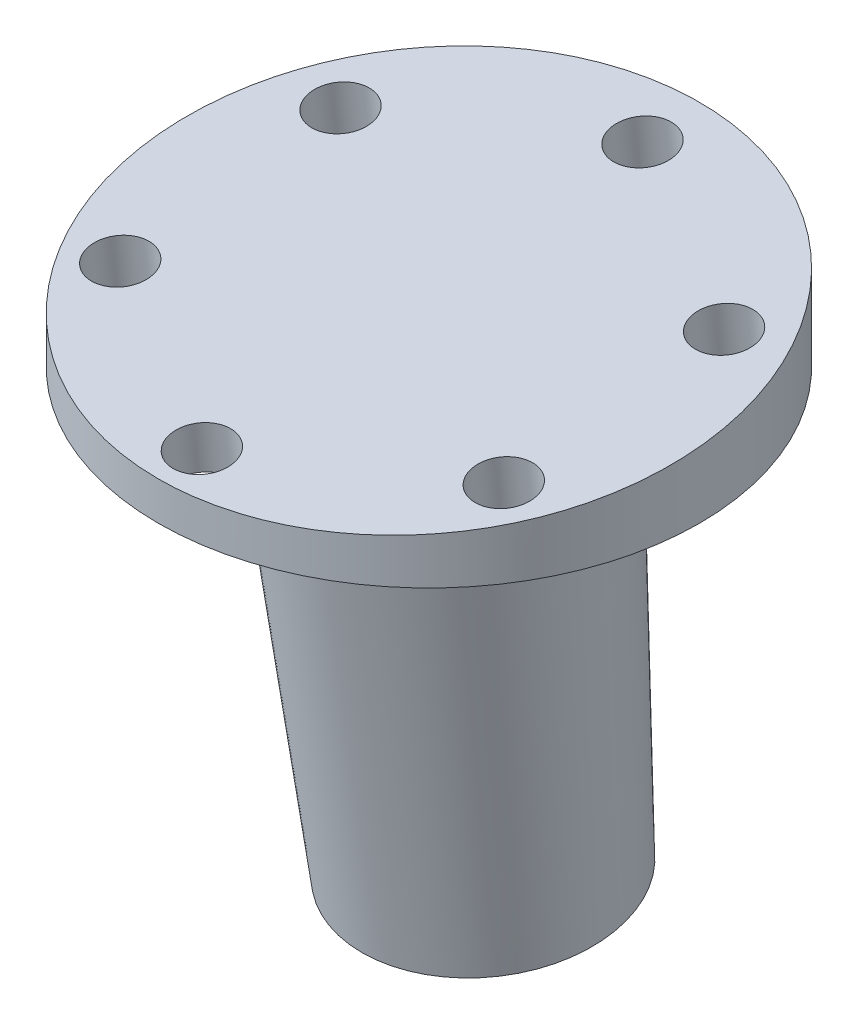
ISO-10303-21;
HEADER;
FILE_DESCRIPTION(('STEP AP214'),'2;1');
FILE_NAME('part.step','',(''),(''),'','','');
FILE_SCHEMA(('AUTOMOTIVE_DESIGN { 1 0 10303 214 1 1 1 1 }'));
ENDSEC;
DATA;
#1=APPLICATION_CONTEXT('core data for automotive mechanical design processes');
#2=APPLICATION_PROTOCOL_DEFINITION('international standard','automotive_design',2000,#1);
#3=PRODUCT_CONTEXT('',#1,'mechanical');
#4=PRODUCT('Part','Part','',(#3));
#5=PRODUCT_RELATED_PRODUCT_CATEGORY('part','',(#4));
#6=PRODUCT_DEFINITION_FORMATION('','',#4);
#7=PRODUCT_DEFINITION_CONTEXT('part definition',#1,'design');
#8=PRODUCT_DEFINITION('design','',#6,#7);
#9=PRODUCT_DEFINITION_SHAPE('','',#8);
#10=(LENGTH_UNIT() NAMED_UNIT(*) SI_UNIT(.MILLI.,.METRE.));
#11=(NAMED_UNIT(*) PLANE_ANGLE_UNIT() SI_UNIT($,.RADIAN.));
#12=(NAMED_UNIT(*) SI_UNIT($,.STERADIAN.) SOLID_ANGLE_UNIT());
#13=UNCERTAINTY_MEASURE_WITH_UNIT(LENGTH_MEASURE(1.E-05),#10,'distance_accuracy_value','');
#14=(GEOMETRIC_REPRESENTATION_CONTEXT(3) GLOBAL_UNCERTAINTY_ASSIGNED_CONTEXT((#13)) GLOBAL_UNIT_ASSIGNED_CONTEXT((#10,
#11,#12)) REPRESENTATION_CONTEXT('',''));
#15=CARTESIAN_POINT('',(0.,0.,0.));
#16=DIRECTION('',(0.,0.,1.));
#17=DIRECTION('',(1.,0.,0.));
#18=AXIS2_PLACEMENT_3D('',#15,#16,#17);
#19=CARTESIAN_POINT('',(0.,-53.9256880404723,-6.33320651284471));
#20=DIRECTION('',(0.,0.994769161943102,0.102148492142657));
#21=DIRECTION('',(0.,-0.102148492142657,0.994769161943102));
#22=AXIS2_PLACEMENT_3D('',#19,#20,#21);
#23=PLANE('',#22);
#24=CARTESIAN_POINT('',(0.,-53.9256880404723,-6.33320651284471));
#25=DIRECTION('',(0.,0.994769161943102,0.102148492142657));
#26=DIRECTION('',(0.,-0.102148492142657,0.994769161943102));
#27=AXIS2_PLACEMENT_3D('',#24,#25,#26);
#28=CIRCLE('',#27,10.0442361468087);
#29=CARTESIAN_POINT('',(0.,-54.9516916175936,3.65848986127483));
#30=VERTEX_POINT('',#29);
#31=EDGE_CURVE('E54',#30,#30,#28,.T.);
#32=ORIENTED_EDGE('',*,*,#31,.T.);
#33=EDGE_LOOP('',(#32));
#34=FACE_BOUND('',#33,.T.);
#35=CARTESIAN_POINT('',(0.,-53.9256880404723,-6.33320651284471));
#36=DIRECTION('',(0.,0.994769161943102,0.102148492142657));
#37=DIRECTION('',(0.,-0.102148492142657,0.994769161943102));
#38=AXIS2_PLACEMENT_3D('',#35,#36,#37);
#39=CIRCLE('',#38,14.25);
#40=CARTESIAN_POINT('',(0.,-55.3813040535052,7.8422540448445));
#41=VERTEX_POINT('',#40);
#42=EDGE_CURVE('E46',#41,#41,#39,.T.);
#43=ORIENTED_EDGE('',*,*,#42,.F.);
#44=EDGE_LOOP('',(#43));
#45=FACE_BOUND('',#44,.T.);
#46=ADVANCED_FACE('F39',(#34,#45),#23,.F.);
#47=CARTESIAN_POINT('',(0.,-53.9256880404723,-6.33320651284471));
#48=DIRECTION('',(0.,0.994769161943102,0.102148492142657));
#49=DIRECTION('',(0.,-0.102148492142657,0.994769161943102));
#50=AXIS2_PLACEMENT_3D('',#47,#48,#49);
#51=CONICAL_SURFACE('',#50,14.25,0.05235987755983);
#52=ORIENTED_EDGE('',*,*,#42,.T.);
#53=EDGE_LOOP('',(#52));
#54=FACE_BOUND('',#53,.T.);
#55=CARTESIAN_POINT('',(0.,0.,-0.703351690237273));
#56=DIRECTION('',(0.,1.,0.));
#57=DIRECTION('',(0.,0.,1.));
#58=AXIS2_PLACEMENT_3D('',#55,#56,#57);
#59=ELLIPSE('',#58,17.1813541602165,17.0912337855842);
#60=CARTESIAN_POINT('',(0.,0.,16.4780024699792));
#61=VERTEX_POINT('',#60);
#62=EDGE_CURVE('E10',#61,#61,#59,.T.);
#63=ORIENTED_EDGE('',*,*,#62,.F.);
#64=EDGE_LOOP('',(#63));
#65=FACE_BOUND('',#64,.T.);
#66=ADVANCED_FACE('F41',(#54,#65),#51,.T.);
#67=CARTESIAN_POINT('',(0.,-4.2,31.65));
#68=DIRECTION('',(0.,-1.,0.));
#69=DIRECTION('',(0.,0.,-1.));
#70=AXIS2_PLACEMENT_3D('',#67,#68,#69);
#71=PLANE('',#70);
#72=CARTESIAN_POINT('',(0.,-4.2,-1.15858147671368));
#73=DIRECTION('',(0.,-1.,0.));
#74=DIRECTION('',(0.,0.,1.));
#75=AXIS2_PLACEMENT_3D('',#72,#73,#74);
#76=ELLIPSE('',#75,12.73091245188,12.6641357246864);
#77=CARTESIAN_POINT('',(0.,-4.2,11.5723309751663));
#78=VERTEX_POINT('',#77);
#79=EDGE_CURVE('E50',#78,#78,#76,.F.);
#80=ORIENTED_EDGE('',*,*,#79,.F.);
#81=EDGE_LOOP('',(#80));
#82=FACE_BOUND('',#81,.T.);
#83=ADVANCED_FACE('F116',(#82),#71,.T.);
#84=CARTESIAN_POINT('',(0.,-53.7070268200809,-6.31075314898146));
#85=DIRECTION('',(0.,0.994769161943102,0.102148492142657));
#86=DIRECTION('',(0.,-0.102148492142657,0.994769161943102));
#87=AXIS2_PLACEMENT_3D('',#84,#85,#86);
#88=CONICAL_SURFACE('',#87,10.0557559540308,0.05235987755983);
#89=ORIENTED_EDGE('',*,*,#31,.F.);
#90=EDGE_LOOP('',(#89));
#91=FACE_BOUND('',#90,.T.);
#92=ORIENTED_EDGE('',*,*,#79,.T.);
#93=EDGE_LOOP('',(#92));
#94=FACE_BOUND('',#93,.T.);
#95=ADVANCED_FACE('F106',(#91,#94),#88,.F.);
#96=CARTESIAN_POINT('',(0.,0.,31.65));
#97=DIRECTION('',(0.,-1.,0.));
#98=DIRECTION('',(0.,0.,-1.));
#99=AXIS2_PLACEMENT_3D('',#96,#97,#98);
#100=PLANE('',#99);
#101=ORIENTED_EDGE('',*,*,#62,.T.);
#102=EDGE_LOOP('',(#101));
#103=FACE_BOUND('',#102,.T.);
#104=CARTESIAN_POINT('',(0.,0.,26.0359656809894));
#105=DIRECTION('',(0.,1.,0.));
#106=DIRECTION('',(0.,0.,1.));
#107=AXIS2_PLACEMENT_3D('',#104,#105,#106);
#108=ELLIPSE('',#107,3.39274690965243,3.375);
#109=CARTESIAN_POINT('',(0.,0.,29.4287125906419));
#110=VERTEX_POINT('',#109);
#111=EDGE_CURVE('E92',#110,#110,#108,.T.);
#112=ORIENTED_EDGE('',*,*,#111,.T.);
#113=EDGE_LOOP('',(#112));
#114=FACE_BOUND('',#113,.T.);
#115=CARTESIAN_POINT('',(22.4298637612226,0.,13.017982840495));
#116=DIRECTION('',(0.,1.,0.));
#117=DIRECTION('',(0.,0.,1.));
#118=AXIS2_PLACEMENT_3D('',#115,#116,#117);
#119=ELLIPSE('',#118,3.39274690965243,3.375);
#120=CARTESIAN_POINT('',(22.4298637612226,0.,16.4107297501474));
#121=VERTEX_POINT('',#120);
#122=EDGE_CURVE('E89',#121,#121,#119,.T.);
#123=ORIENTED_EDGE('',*,*,#122,.T.);
#124=EDGE_LOOP('',(#123));
#125=FACE_BOUND('',#124,.T.);
#126=CARTESIAN_POINT('',(22.4298637612229,0.,-13.0179828404945));
#127=DIRECTION('',(0.,1.,0.));
#128=DIRECTION('',(0.,0.,1.));
#129=AXIS2_PLACEMENT_3D('',#126,#127,#128);
#130=ELLIPSE('',#129,3.39274690965243,3.375);
#131=CARTESIAN_POINT('',(22.4298637612229,0.,-9.62523593084208));
#132=VERTEX_POINT('',#131);
#133=EDGE_CURVE('E86',#132,#132,#130,.T.);
#134=ORIENTED_EDGE('',*,*,#133,.T.);
#135=EDGE_LOOP('',(#134));
#136=FACE_BOUND('',#135,.T.);
#137=CARTESIAN_POINT('',(1.78206552359005E-13,0.,-26.0359656809894));
#138=DIRECTION('',(0.,1.,0.));
#139=DIRECTION('',(0.,0.,1.));
#140=AXIS2_PLACEMENT_3D('',#137,#138,#139);
#141=ELLIPSE('',#140,3.39274690965243,3.375);
#142=CARTESIAN_POINT('',(1.78206552359005E-13,0.,-22.643218771337));
#143=VERTEX_POINT('',#142);
#144=EDGE_CURVE('E83',#143,#143,#141,.T.);
#145=ORIENTED_EDGE('',*,*,#144,.T.);
#146=EDGE_LOOP('',(#145));
#147=FACE_BOUND('',#146,.T.);
#148=CARTESIAN_POINT('',(-22.4298637612227,0.,-13.0179828404948));
#149=DIRECTION('',(0.,1.,0.));
#150=DIRECTION('',(0.,0.,1.));
#151=AXIS2_PLACEMENT_3D('',#148,#149,#150);
#152=ELLIPSE('',#151,3.39274690965243,3.375);
#153=CARTESIAN_POINT('',(-22.4298637612227,0.,-9.6252359308424));
#154=VERTEX_POINT('',#153);
#155=EDGE_CURVE('E80',#154,#154,#152,.T.);
#156=ORIENTED_EDGE('',*,*,#155,.T.);
#157=EDGE_LOOP('',(#156));
#158=FACE_BOUND('',#157,.T.);
#159=CARTESIAN_POINT('',(-22.4298637612228,0.,13.0179828404947));
#160=DIRECTION('',(0.,1.,0.));
#161=DIRECTION('',(0.,0.,1.));
#162=AXIS2_PLACEMENT_3D('',#159,#160,#161);
#163=ELLIPSE('',#162,3.39274690965243,3.375);
#164=CARTESIAN_POINT('',(-22.4298637612228,0.,16.4107297501471));
#165=VERTEX_POINT('',#164);
#166=EDGE_CURVE('E64',#165,#165,#163,.T.);
#167=ORIENTED_EDGE('',*,*,#166,.T.);
#168=EDGE_LOOP('',(#167));
#169=FACE_BOUND('',#168,.T.);
#170=CARTESIAN_POINT('',(0.,0.,0.));
#171=DIRECTION('',(0.,1.,0.));
#172=DIRECTION('',(0.,0.,1.));
#173=AXIS2_PLACEMENT_3D('',#170,#171,#172);
#174=CIRCLE('',#173,31.65);
#175=CARTESIAN_POINT('',(0.,0.,31.65));
#176=VERTEX_POINT('',#175);
#177=EDGE_CURVE('E98',#176,#176,#174,.T.);
#178=ORIENTED_EDGE('',*,*,#177,.F.);
#179=EDGE_LOOP('',(#178));
#180=FACE_BOUND('',#179,.T.);
#181=ADVANCED_FACE('F104',(#103,#114,#125,#136,#147,#158,#169,#180),#100,.T.);
#182=CARTESIAN_POINT('',(0.,11.,0.));
#183=DIRECTION('',(0.,-1.,0.));
#184=DIRECTION('',(0.,0.,-1.));
#185=AXIS2_PLACEMENT_3D('',#182,#183,#184);
#186=CYLINDRICAL_SURFACE('',#185,31.65);
#187=CARTESIAN_POINT('',(0.,7.75,0.));
#188=DIRECTION('',(0.,-0.994769161943102,-0.102148492142657));
#189=DIRECTION('',(0.,-0.102148492142657,0.994769161943102));
#190=AXIS2_PLACEMENT_3D('',#187,#188,#189);
#191=ELLIPSE('',#190,31.8164265749628,31.65);
#192=CARTESIAN_POINT('',(0.,4.5,31.65));
#193=VERTEX_POINT('',#192);
#194=EDGE_CURVE('E95',#193,#193,#191,.T.);
#195=ORIENTED_EDGE('',*,*,#194,.T.);
#196=EDGE_LOOP('',(#195));
#197=FACE_BOUND('',#196,.T.);
#198=ORIENTED_EDGE('',*,*,#177,.T.);
#199=EDGE_LOOP('',(#198));
#200=FACE_BOUND('',#199,.T.);
#201=ADVANCED_FACE('F102',(#197,#200),#186,.T.);
#202=CARTESIAN_POINT('',(-35.5,11.,-31.65));
#203=DIRECTION('',(0.,-0.994769161943102,-0.102148492142657));
#204=DIRECTION('',(0.,0.102148492142657,-0.994769161943102));
#205=AXIS2_PLACEMENT_3D('',#202,#203,#204);
#206=PLANE('',#205);
#207=CARTESIAN_POINT('',(0.,5.02351102223112,26.5518080450416));
#208=DIRECTION('',(0.,0.994769161943102,0.102148492142657));
#209=DIRECTION('',(0.,-0.102148492142657,0.994769161943102));
#210=AXIS2_PLACEMENT_3D('',#207,#208,#209);
#211=CIRCLE('',#210,3.375);
#212=CARTESIAN_POINT('',(0.,4.67875986124965,29.9091539665996));
#213=VERTEX_POINT('',#212);
#214=EDGE_CURVE('E60',#213,#213,#211,.T.);
#215=ORIENTED_EDGE('',*,*,#214,.F.);
#216=EDGE_LOOP('',(#215));
#217=FACE_BOUND('',#216,.T.);
#218=CARTESIAN_POINT('',(22.4298637612226,6.34632254263334,13.6696589309708));
#219=DIRECTION('',(0.,0.994769161943102,0.102148492142657));
#220=DIRECTION('',(0.,-0.102148492142657,0.994769161943102));
#221=AXIS2_PLACEMENT_3D('',#218,#219,#220);
#222=CIRCLE('',#221,3.375);
#223=CARTESIAN_POINT('',(22.4298637612226,6.00157138165187,17.0270048525287));
#224=VERTEX_POINT('',#223);
#225=EDGE_CURVE('E58',#224,#224,#222,.T.);
#226=ORIENTED_EDGE('',*,*,#225,.F.);
#227=EDGE_LOOP('',(#226));
#228=FACE_BOUND('',#227,.T.);
#229=CARTESIAN_POINT('',(22.4298637612229,8.99194558343784,-12.0946392971715));
#230=DIRECTION('',(0.,0.994769161943102,0.102148492142657));
#231=DIRECTION('',(0.,-0.102148492142657,0.994769161943102));
#232=AXIS2_PLACEMENT_3D('',#229,#230,#231);
#233=CIRCLE('',#232,3.375);
#234=CARTESIAN_POINT('',(22.4298637612229,8.64719442245637,-8.73729337561354));
#235=VERTEX_POINT('',#234);
#236=EDGE_CURVE('E67',#235,#235,#233,.T.);
#237=ORIENTED_EDGE('',*,*,#236,.F.);
#238=EDGE_LOOP('',(#237));
#239=FACE_BOUND('',#238,.T.);
#240=CARTESIAN_POINT('',(1.78206552359005E-13,10.3147571038401,-24.9767884112428));
#241=DIRECTION('',(0.,0.994769161943102,0.102148492142657));
#242=DIRECTION('',(0.,-0.102148492142657,0.994769161943102));
#243=AXIS2_PLACEMENT_3D('',#240,#241,#242);
#244=CIRCLE('',#243,3.375);
#245=CARTESIAN_POINT('',(1.78206552359005E-13,9.97000594285864,-21.6194424896849));
#246=VERTEX_POINT('',#245);
#247=EDGE_CURVE('E73',#246,#246,#244,.T.);
#248=ORIENTED_EDGE('',*,*,#247,.F.);
#249=EDGE_LOOP('',(#248));
#250=FACE_BOUND('',#249,.T.);
#251=CARTESIAN_POINT('',(-22.4298637612227,8.99194558343787,-12.0946392971718));
#252=DIRECTION('',(0.,0.994769161943102,0.102148492142657));
#253=DIRECTION('',(0.,-0.102148492142657,0.994769161943102));
#254=AXIS2_PLACEMENT_3D('',#251,#252,#253);
#255=CIRCLE('',#254,3.375);
#256=CARTESIAN_POINT('',(-22.4298637612227,8.6471944224564,-8.73729337561386));
#257=VERTEX_POINT('',#256);
#258=EDGE_CURVE('E70',#257,#257,#255,.T.);
#259=ORIENTED_EDGE('',*,*,#258,.F.);
#260=EDGE_LOOP('',(#259));
#261=FACE_BOUND('',#260,.T.);
#262=CARTESIAN_POINT('',(-22.4298637612228,6.34632254263337,13.6696589309704));
#263=DIRECTION('',(0.,0.994769161943102,0.102148492142657));
#264=DIRECTION('',(0.,-0.102148492142657,0.994769161943102));
#265=AXIS2_PLACEMENT_3D('',#262,#263,#264);
#266=CIRCLE('',#265,3.375);
#267=CARTESIAN_POINT('',(-22.4298637612228,6.0015713816519,17.0270048525284));
#268=VERTEX_POINT('',#267);
#269=EDGE_CURVE('E63',#268,#268,#266,.T.);
#270=ORIENTED_EDGE('',*,*,#269,.F.);
#271=EDGE_LOOP('',(#270));
#272=FACE_BOUND('',#271,.T.);
#273=ORIENTED_EDGE('',*,*,#194,.F.);
#274=EDGE_LOOP('',(#273));
#275=FACE_BOUND('',#274,.T.);
#276=ADVANCED_FACE('F113',(#217,#228,#239,#250,#261,#272,#275),#206,.F.);
#277=CARTESIAN_POINT('',(-22.4298637612228,-14.5438298581718,11.5245405959747));
#278=DIRECTION('',(0.,0.994769161943102,0.102148492142657));
#279=DIRECTION('',(0.,-0.102148492142657,0.994769161943102));
#280=AXIS2_PLACEMENT_3D('',#277,#278,#279);
#281=CYLINDRICAL_SURFACE('',#280,3.375);
#282=ORIENTED_EDGE('',*,*,#269,.T.);
#283=EDGE_LOOP('',(#282));
#284=FACE_BOUND('',#283,.T.);
#285=ORIENTED_EDGE('',*,*,#166,.F.);
#286=EDGE_LOOP('',(#285));
#287=FACE_BOUND('',#286,.T.);
#288=ADVANCED_FACE('F176',(#284,#287),#281,.F.);
#289=CARTESIAN_POINT('',(-22.4298637612227,-11.8982068173673,-14.2397576321676));
#290=DIRECTION('',(0.,0.994769161943102,0.102148492142657));
#291=DIRECTION('',(0.,-0.102148492142657,0.994769161943102));
#292=AXIS2_PLACEMENT_3D('',#289,#290,#291);
#293=CYLINDRICAL_SURFACE('',#292,3.375);
#294=ORIENTED_EDGE('',*,*,#258,.T.);
#295=EDGE_LOOP('',(#294));
#296=FACE_BOUND('',#295,.T.);
#297=ORIENTED_EDGE('',*,*,#155,.F.);
#298=EDGE_LOOP('',(#297));
#299=FACE_BOUND('',#298,.T.);
#300=ADVANCED_FACE('F185',(#296,#299),#293,.F.);
#301=CARTESIAN_POINT('',(1.78206552359005E-13,-10.575395296965,-27.1219067462386));
#302=DIRECTION('',(0.,0.994769161943102,0.102148492142657));
#303=DIRECTION('',(0.,-0.102148492142657,0.994769161943102));
#304=AXIS2_PLACEMENT_3D('',#301,#302,#303);
#305=CYLINDRICAL_SURFACE('',#304,3.375);
#306=ORIENTED_EDGE('',*,*,#247,.T.);
#307=EDGE_LOOP('',(#306));
#308=FACE_BOUND('',#307,.T.);
#309=ORIENTED_EDGE('',*,*,#144,.F.);
#310=EDGE_LOOP('',(#309));
#311=FACE_BOUND('',#310,.T.);
#312=ADVANCED_FACE('F194',(#308,#311),#305,.F.);
#313=CARTESIAN_POINT('',(22.4298637612229,-11.8982068173673,-14.2397576321673));
#314=DIRECTION('',(0.,0.994769161943102,0.102148492142657));
#315=DIRECTION('',(0.,-0.102148492142657,0.994769161943102));
#316=AXIS2_PLACEMENT_3D('',#313,#314,#315);
#317=CYLINDRICAL_SURFACE('',#316,3.375);
#318=ORIENTED_EDGE('',*,*,#236,.T.);
#319=EDGE_LOOP('',(#318));
#320=FACE_BOUND('',#319,.T.);
#321=ORIENTED_EDGE('',*,*,#133,.F.);
#322=EDGE_LOOP('',(#321));
#323=FACE_BOUND('',#322,.T.);
#324=ADVANCED_FACE('F203',(#320,#323),#317,.F.);
#325=CARTESIAN_POINT('',(22.4298637612226,-14.5438298581718,11.524540595975));
#326=DIRECTION('',(0.,0.994769161943102,0.102148492142657));
#327=DIRECTION('',(0.,-0.102148492142657,0.994769161943102));
#328=AXIS2_PLACEMENT_3D('',#325,#326,#327);
#329=CYLINDRICAL_SURFACE('',#328,3.375);
#330=ORIENTED_EDGE('',*,*,#225,.T.);
#331=EDGE_LOOP('',(#330));
#332=FACE_BOUND('',#331,.T.);
#333=ORIENTED_EDGE('',*,*,#122,.F.);
#334=EDGE_LOOP('',(#333));
#335=FACE_BOUND('',#334,.T.);
#336=ADVANCED_FACE('F123',(#332,#335),#329,.F.);
#337=CARTESIAN_POINT('',(0.,-15.866641378574,24.4066897100458));
#338=DIRECTION('',(0.,0.994769161943102,0.102148492142657));
#339=DIRECTION('',(0.,-0.102148492142657,0.994769161943102));
#340=AXIS2_PLACEMENT_3D('',#337,#338,#339);
#341=CYLINDRICAL_SURFACE('',#340,3.375);
#342=ORIENTED_EDGE('',*,*,#214,.T.);
#343=EDGE_LOOP('',(#342));
#344=FACE_BOUND('',#343,.T.);
#345=ORIENTED_EDGE('',*,*,#111,.F.);
#346=EDGE_LOOP('',(#345));
#347=FACE_BOUND('',#346,.T.);
#348=ADVANCED_FACE('F108',(#344,#347),#341,.F.);
#349=CLOSED_SHELL('',(#46,#66,#83,#95,#181,#201,#276,#288,#300,#312,#324,#336,#348));
#350=MANIFOLD_SOLID_BREP('B2',#349);
#351=ADVANCED_BREP_SHAPE_REPRESENTATION('',(#18,#350),#14);
#352=SHAPE_DEFINITION_REPRESENTATION(#9,#351);
ENDSEC;
END-ISO-10303-21;
